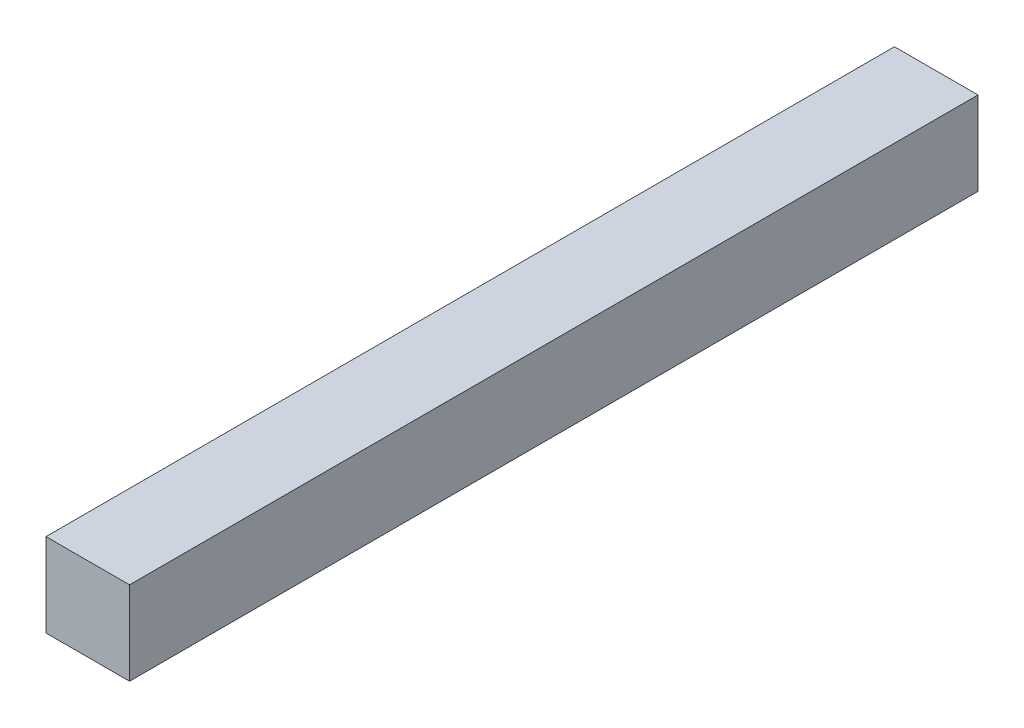
ISO-10303-21;
HEADER;
FILE_DESCRIPTION(('STEP AP214'),'2;1');
FILE_NAME('part.step','',(''),(''),'','','');
FILE_SCHEMA(('AUTOMOTIVE_DESIGN { 1 0 10303 214 1 1 1 1 }'));
ENDSEC;
DATA;
#1=APPLICATION_CONTEXT('core data for automotive mechanical design processes');
#2=APPLICATION_PROTOCOL_DEFINITION('international standard','automotive_design',2000,#1);
#3=PRODUCT_CONTEXT('',#1,'mechanical');
#4=PRODUCT('Part','Part','',(#3));
#5=PRODUCT_RELATED_PRODUCT_CATEGORY('part','',(#4));
#6=PRODUCT_DEFINITION_FORMATION('','',#4);
#7=PRODUCT_DEFINITION_CONTEXT('part definition',#1,'design');
#8=PRODUCT_DEFINITION('design','',#6,#7);
#9=PRODUCT_DEFINITION_SHAPE('','',#8);
#10=(LENGTH_UNIT() NAMED_UNIT(*) SI_UNIT(.MILLI.,.METRE.));
#11=(NAMED_UNIT(*) PLANE_ANGLE_UNIT() SI_UNIT($,.RADIAN.));
#12=(NAMED_UNIT(*) SI_UNIT($,.STERADIAN.) SOLID_ANGLE_UNIT());
#13=UNCERTAINTY_MEASURE_WITH_UNIT(LENGTH_MEASURE(1.E-05),#10,'distance_accuracy_value','');
#14=(GEOMETRIC_REPRESENTATION_CONTEXT(3) GLOBAL_UNCERTAINTY_ASSIGNED_CONTEXT((#13)) GLOBAL_UNIT_ASSIGNED_CONTEXT((#10,
#11,#12)) REPRESENTATION_CONTEXT('',''));
#15=CARTESIAN_POINT('',(0.,0.,0.));
#16=DIRECTION('',(0.,0.,1.));
#17=DIRECTION('',(1.,0.,0.));
#18=AXIS2_PLACEMENT_3D('',#15,#16,#17);
#19=CARTESIAN_POINT('',(-5.,5.,101.6025));
#20=DIRECTION('',(1.,0.,0.));
#21=DIRECTION('',(0.,1.,0.));
#22=AXIS2_PLACEMENT_3D('',#19,#20,#21);
#23=PLANE('',#22);
#24=DIRECTION('',(0.,-1.,0.));
#25=VECTOR('',#24,1.);
#26=CARTESIAN_POINT('',(-5.,5.,0.));
#27=LINE('',#26,#25);
#28=CARTESIAN_POINT('',(-5.,5.,0.));
#29=VERTEX_POINT('',#28);
#30=CARTESIAN_POINT('',(-5.,-5.,0.));
#31=VERTEX_POINT('',#30);
#32=EDGE_CURVE('E95',#29,#31,#27,.T.);
#33=ORIENTED_EDGE('',*,*,#32,.T.);
#34=DIRECTION('',(0.,0.,-1.));
#35=VECTOR('',#34,1.);
#36=CARTESIAN_POINT('',(-5.,-5.,101.6025));
#37=LINE('',#36,#35);
#38=CARTESIAN_POINT('',(-5.,-5.,101.6025));
#39=VERTEX_POINT('',#38);
#40=EDGE_CURVE('E11',#39,#31,#37,.T.);
#41=ORIENTED_EDGE('',*,*,#40,.F.);
#42=DIRECTION('',(0.,-1.,0.));
#43=VECTOR('',#42,1.);
#44=CARTESIAN_POINT('',(-5.,5.,101.6025));
#45=LINE('',#44,#43);
#46=CARTESIAN_POINT('',(-5.,5.,101.6025));
#47=VERTEX_POINT('',#46);
#48=EDGE_CURVE('E83',#47,#39,#45,.T.);
#49=ORIENTED_EDGE('',*,*,#48,.F.);
#50=DIRECTION('',(0.,0.,-1.));
#51=VECTOR('',#50,1.);
#52=CARTESIAN_POINT('',(-5.,5.,101.6025));
#53=LINE('',#52,#51);
#54=EDGE_CURVE('E91',#47,#29,#53,.T.);
#55=ORIENTED_EDGE('',*,*,#54,.T.);
#56=EDGE_LOOP('',(#33,#41,#49,#55));
#57=FACE_BOUND('',#56,.T.);
#58=ADVANCED_FACE('F32',(#57),#23,.F.);
#59=CARTESIAN_POINT('',(5.,-5.,101.6025));
#60=DIRECTION('',(0.,1.,0.));
#61=DIRECTION('',(-1.,0.,0.));
#62=AXIS2_PLACEMENT_3D('',#59,#60,#61);
#63=PLANE('',#62);
#64=DIRECTION('',(1.,0.,0.));
#65=VECTOR('',#64,1.);
#66=CARTESIAN_POINT('',(5.,-5.,0.));
#67=LINE('',#66,#65);
#68=CARTESIAN_POINT('',(5.,-5.,0.));
#69=VERTEX_POINT('',#68);
#70=EDGE_CURVE('E87',#31,#69,#67,.T.);
#71=ORIENTED_EDGE('',*,*,#70,.T.);
#72=DIRECTION('',(0.,0.,-1.));
#73=VECTOR('',#72,1.);
#74=CARTESIAN_POINT('',(5.,-5.,101.6025));
#75=LINE('',#74,#73);
#76=CARTESIAN_POINT('',(5.,-5.,101.6025));
#77=VERTEX_POINT('',#76);
#78=EDGE_CURVE('E40',#77,#69,#75,.T.);
#79=ORIENTED_EDGE('',*,*,#78,.F.);
#80=DIRECTION('',(1.,0.,0.));
#81=VECTOR('',#80,1.);
#82=CARTESIAN_POINT('',(5.,-5.,101.6025));
#83=LINE('',#82,#81);
#84=EDGE_CURVE('E78',#39,#77,#83,.T.);
#85=ORIENTED_EDGE('',*,*,#84,.F.);
#86=ORIENTED_EDGE('',*,*,#40,.T.);
#87=EDGE_LOOP('',(#71,#79,#85,#86));
#88=FACE_BOUND('',#87,.T.);
#89=ADVANCED_FACE('F86',(#88),#63,.F.);
#90=CARTESIAN_POINT('',(5.,5.,101.6025));
#91=DIRECTION('',(-1.,0.,0.));
#92=DIRECTION('',(0.,-1.,0.));
#93=AXIS2_PLACEMENT_3D('',#90,#91,#92);
#94=PLANE('',#93);
#95=DIRECTION('',(0.,1.,0.));
#96=VECTOR('',#95,1.);
#97=CARTESIAN_POINT('',(5.,5.,0.));
#98=LINE('',#97,#96);
#99=CARTESIAN_POINT('',(5.,5.,0.));
#100=VERTEX_POINT('',#99);
#101=EDGE_CURVE('E65',#69,#100,#98,.T.);
#102=ORIENTED_EDGE('',*,*,#101,.T.);
#103=DIRECTION('',(0.,0.,-1.));
#104=VECTOR('',#103,1.);
#105=CARTESIAN_POINT('',(5.,5.,101.6025));
#106=LINE('',#105,#104);
#107=CARTESIAN_POINT('',(5.,5.,101.6025));
#108=VERTEX_POINT('',#107);
#109=EDGE_CURVE('E88',#108,#100,#106,.T.);
#110=ORIENTED_EDGE('',*,*,#109,.F.);
#111=DIRECTION('',(0.,1.,0.));
#112=VECTOR('',#111,1.);
#113=CARTESIAN_POINT('',(5.,5.,101.6025));
#114=LINE('',#113,#112);
#115=EDGE_CURVE('E81',#77,#108,#114,.T.);
#116=ORIENTED_EDGE('',*,*,#115,.F.);
#117=ORIENTED_EDGE('',*,*,#78,.T.);
#118=EDGE_LOOP('',(#102,#110,#116,#117));
#119=FACE_BOUND('',#118,.T.);
#120=ADVANCED_FACE('F89',(#119),#94,.F.);
#121=CARTESIAN_POINT('',(5.,5.,101.6025));
#122=DIRECTION('',(0.,-1.,0.));
#123=DIRECTION('',(1.,0.,0.));
#124=AXIS2_PLACEMENT_3D('',#121,#122,#123);
#125=PLANE('',#124);
#126=DIRECTION('',(-1.,0.,0.));
#127=VECTOR('',#126,1.);
#128=CARTESIAN_POINT('',(5.,5.,0.));
#129=LINE('',#128,#127);
#130=EDGE_CURVE('E71',#100,#29,#129,.T.);
#131=ORIENTED_EDGE('',*,*,#130,.T.);
#132=ORIENTED_EDGE('',*,*,#54,.F.);
#133=DIRECTION('',(-1.,0.,0.));
#134=VECTOR('',#133,1.);
#135=CARTESIAN_POINT('',(5.,5.,101.6025));
#136=LINE('',#135,#134);
#137=EDGE_CURVE('E48',#108,#47,#136,.T.);
#138=ORIENTED_EDGE('',*,*,#137,.F.);
#139=ORIENTED_EDGE('',*,*,#109,.T.);
#140=EDGE_LOOP('',(#131,#132,#138,#139));
#141=FACE_BOUND('',#140,.T.);
#142=ADVANCED_FACE('F102',(#141),#125,.F.);
#143=CARTESIAN_POINT('',(0.,0.,101.6025));
#144=DIRECTION('',(0.,0.,-1.));
#145=DIRECTION('',(-1.,0.,0.));
#146=AXIS2_PLACEMENT_3D('',#143,#144,#145);
#147=PLANE('',#146);
#148=ORIENTED_EDGE('',*,*,#48,.T.);
#149=ORIENTED_EDGE('',*,*,#84,.T.);
#150=ORIENTED_EDGE('',*,*,#115,.T.);
#151=ORIENTED_EDGE('',*,*,#137,.T.);
#152=EDGE_LOOP('',(#148,#149,#150,#151));
#153=FACE_BOUND('',#152,.T.);
#154=ADVANCED_FACE('F79',(#153),#147,.F.);
#155=CARTESIAN_POINT('',(0.,0.,0.));
#156=DIRECTION('',(0.,0.,-1.));
#157=DIRECTION('',(-1.,0.,0.));
#158=AXIS2_PLACEMENT_3D('',#155,#156,#157);
#159=PLANE('',#158);
#160=ORIENTED_EDGE('',*,*,#32,.F.);
#161=ORIENTED_EDGE('',*,*,#130,.F.);
#162=ORIENTED_EDGE('',*,*,#101,.F.);
#163=ORIENTED_EDGE('',*,*,#70,.F.);
#164=EDGE_LOOP('',(#160,#161,#162,#163));
#165=FACE_BOUND('',#164,.T.);
#166=ADVANCED_FACE('F105',(#165),#159,.T.);
#167=CLOSED_SHELL('',(#58,#89,#120,#142,#154,#166));
#168=MANIFOLD_SOLID_BREP('B2',#167);
#169=ADVANCED_BREP_SHAPE_REPRESENTATION('',(#18,#168),#14);
#170=SHAPE_DEFINITION_REPRESENTATION(#9,#169);
ENDSEC;
END-ISO-10303-21;
